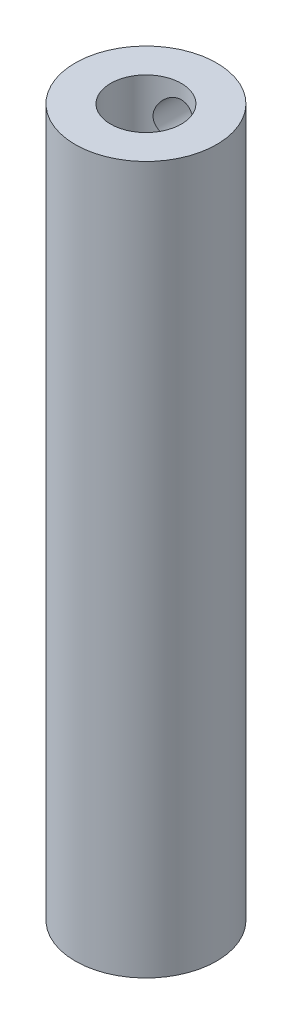
ISO-10303-21;
HEADER;
FILE_DESCRIPTION(('STEP AP214'),'2;1');
FILE_NAME('part.step','',(''),(''),'','','');
FILE_SCHEMA(('AUTOMOTIVE_DESIGN { 1 0 10303 214 1 1 1 1 }'));
ENDSEC;
DATA;
#1=APPLICATION_CONTEXT('core data for automotive mechanical design processes');
#2=APPLICATION_PROTOCOL_DEFINITION('international standard','automotive_design',2000,#1);
#3=PRODUCT_CONTEXT('',#1,'mechanical');
#4=PRODUCT('Part','Part','',(#3));
#5=PRODUCT_RELATED_PRODUCT_CATEGORY('part','',(#4));
#6=PRODUCT_DEFINITION_FORMATION('','',#4);
#7=PRODUCT_DEFINITION_CONTEXT('part definition',#1,'design');
#8=PRODUCT_DEFINITION('design','',#6,#7);
#9=PRODUCT_DEFINITION_SHAPE('','',#8);
#10=(LENGTH_UNIT() NAMED_UNIT(*) SI_UNIT(.MILLI.,.METRE.));
#11=(NAMED_UNIT(*) PLANE_ANGLE_UNIT() SI_UNIT($,.RADIAN.));
#12=(NAMED_UNIT(*) SI_UNIT($,.STERADIAN.) SOLID_ANGLE_UNIT());
#13=UNCERTAINTY_MEASURE_WITH_UNIT(LENGTH_MEASURE(1.E-05),#10,'distance_accuracy_value','');
#14=(GEOMETRIC_REPRESENTATION_CONTEXT(3) GLOBAL_UNCERTAINTY_ASSIGNED_CONTEXT((#13)) GLOBAL_UNIT_ASSIGNED_CONTEXT((#10,
#11,#12)) REPRESENTATION_CONTEXT('',''));
#15=CARTESIAN_POINT('',(0.,0.,0.));
#16=DIRECTION('',(0.,0.,1.));
#17=DIRECTION('',(1.,0.,0.));
#18=AXIS2_PLACEMENT_3D('',#15,#16,#17);
#19=CARTESIAN_POINT('',(0.,100.,0.));
#20=DIRECTION('',(0.,-1.,0.));
#21=DIRECTION('',(0.,0.,-1.));
#22=AXIS2_PLACEMENT_3D('',#19,#20,#21);
#23=CYLINDRICAL_SURFACE('',#22,10.);
#24=CARTESIAN_POINT('',(0.,98.,-10.));
#25=CARTESIAN_POINT('',(-0.1645772255066,97.9999980050302,-9.99999858501101));
#26=CARTESIAN_POINT('',(-0.32917463670306,97.9864122727521,-9.99589831387907));
#27=CARTESIAN_POINT('',(-0.653576250609763,97.9325572915558,-9.97994211187382));
#28=CARTESIAN_POINT('',(-0.81337900882284,97.8922800839533,-9.96808386779384));
#29=CARTESIAN_POINT('',(-1.12346541550906,97.7865079661795,-9.93791105003673));
#30=CARTESIAN_POINT('',(-1.27376272879075,97.7210502607621,-9.91960600500851));
#31=CARTESIAN_POINT('',(-1.56124836210627,97.5669278138883,-9.8784421847529));
#32=CARTESIAN_POINT('',(-1.69843493493934,97.4782599852092,-9.85558280384133));
#33=CARTESIAN_POINT('',(-1.95974359436749,97.2775519850547,-9.80701474385548));
#34=CARTESIAN_POINT('',(-2.08343614248869,97.1649667482282,-9.78124767314072));
#35=CARTESIAN_POINT('',(-2.31049841846648,96.9207815401796,-9.73011668420884));
#36=CARTESIAN_POINT('',(-2.41386472654882,96.7891783757501,-9.70475283449003));
#37=CARTESIAN_POINT('',(-2.59960075447416,96.5070584939248,-9.65668227987544));
#38=CARTESIAN_POINT('',(-2.68144618044427,96.3561830780185,-9.63404813327749));
#39=CARTESIAN_POINT('',(-2.81842789549521,96.0420214915394,-9.59487240788062));
#40=CARTESIAN_POINT('',(-2.87357059839947,95.8787383121441,-9.57832936626621));
#41=CARTESIAN_POINT('',(-2.95403267365304,95.5492194677391,-9.55381741676868));
#42=CARTESIAN_POINT('',(-2.98014392469355,95.3831945122721,-9.54562138649067));
#43=CARTESIAN_POINT('',(-3.00427461229344,95.0489336875665,-9.53805579499534));
#44=CARTESIAN_POINT('',(-3.00230085522157,94.8806983638818,-9.53868409521142));
#45=CARTESIAN_POINT('',(-2.97093954399624,94.553232182783,-9.54849488135555));
#46=CARTESIAN_POINT('',(-2.9425441052537,94.3938954992755,-9.55736777198281));
#47=CARTESIAN_POINT('',(-2.86074840854112,94.0823604274531,-9.58216712457249));
#48=CARTESIAN_POINT('',(-2.80734568283282,93.9301627452513,-9.59809428264701));
#49=CARTESIAN_POINT('',(-2.67632053307363,93.6347993006785,-9.63545466149946));
#50=CARTESIAN_POINT('',(-2.59837633869285,93.4917858320895,-9.65696032231904));
#51=CARTESIAN_POINT('',(-2.42070445177366,93.2205359559796,-9.70301974000129));
#52=CARTESIAN_POINT('',(-2.32097148005177,93.0923031411724,-9.72757423493982));
#53=CARTESIAN_POINT('',(-2.09762581531093,92.848627618476,-9.77822022595874));
#54=CARTESIAN_POINT('',(-1.97318981493395,92.7339426719407,-9.80433308620996));
#55=CARTESIAN_POINT('',(-1.70652651862793,92.5268920318715,-9.85424488126517));
#56=CARTESIAN_POINT('',(-1.56429810372178,92.4345277431711,-9.8780436703682));
#57=CARTESIAN_POINT('',(-1.2647100766856,92.2742801550705,-9.92086320138941));
#58=CARTESIAN_POINT('',(-1.1072554994959,92.2065649675003,-9.93985087336628));
#59=CARTESIAN_POINT('',(-0.782490831207035,92.0988008198007,-9.97067043664444));
#60=CARTESIAN_POINT('',(-0.615183503179159,92.058744142935,-9.98250432373999));
#61=CARTESIAN_POINT('',(-0.28190448533666,92.0086956442012,-9.99736729287077));
#62=CARTESIAN_POINT('',(-0.11610019520237,91.9976768283968,-10.0006970083558));
#63=CARTESIAN_POINT('',(0.21499921164677,92.0031383114242,-9.99905846483519));
#64=CARTESIAN_POINT('',(0.380294393381566,92.0196149393029,-9.99409131355514));
#65=CARTESIAN_POINT('',(0.701807210619397,92.078769222223,-9.97661393974325));
#66=CARTESIAN_POINT('',(0.85814554522834,92.1208467751618,-9.96427659598829));
#67=CARTESIAN_POINT('',(1.16150927790904,92.2292864655564,-9.9334869568307));
#68=CARTESIAN_POINT('',(1.30853355405117,92.2956515220757,-9.91503392642188));
#69=CARTESIAN_POINT('',(1.59287437892211,92.4525063309623,-9.87339308702631));
#70=CARTESIAN_POINT('',(1.72988765239934,92.543518681896,-9.8501056165928));
#71=CARTESIAN_POINT('',(1.9870466159603,92.7464495081056,-9.80146937528704));
#72=CARTESIAN_POINT('',(2.10718806471189,92.8583732237753,-9.77612008862419));
#73=CARTESIAN_POINT('',(2.33171489102053,93.1047746167387,-9.72506343738006));
#74=CARTESIAN_POINT('',(2.43536962463001,93.2399237515436,-9.69937650065513));
#75=CARTESIAN_POINT('',(2.61857990144313,93.5262558780269,-9.65153030477949));
#76=CARTESIAN_POINT('',(2.69813607658965,93.6774384491158,-9.62937095313121));
#77=CARTESIAN_POINT('',(2.83034694254316,93.99106498251,-9.5913437922631));
#78=CARTESIAN_POINT('',(2.88312693874022,94.1534523730757,-9.57544675673501));
#79=CARTESIAN_POINT('',(2.96043461630306,94.4853759378605,-9.55183188739737));
#80=CARTESIAN_POINT('',(2.98497197957849,94.6549096415661,-9.54411125069387));
#81=CARTESIAN_POINT('',(3.0044396896993,94.9887230367768,-9.53799944941558));
#82=CARTESIAN_POINT('',(3.00056110615887,95.1529273020988,-9.53923294700394));
#83=CARTESIAN_POINT('',(2.96615010888611,95.4782282068012,-9.54998802392188));
#84=CARTESIAN_POINT('',(2.93561876249408,95.639324970361,-9.55950927135902));
#85=CARTESIAN_POINT('',(2.84953777608686,95.9518907982633,-9.58551527389243));
#86=CARTESIAN_POINT('',(2.79430351014248,96.1034545747174,-9.60191209104934));
#87=CARTESIAN_POINT('',(2.66063014242148,96.3952848776414,-9.63980557805265));
#88=CARTESIAN_POINT('',(2.58218659925723,96.5355492352832,-9.6613032238508));
#89=CARTESIAN_POINT('',(2.40097527610176,96.8063262330525,-9.70795352855338));
#90=CARTESIAN_POINT('',(2.29742552185996,96.9362975225204,-9.7332108032858));
#91=CARTESIAN_POINT('',(2.07034869259555,97.1774049966162,-9.78402640899066));
#92=CARTESIAN_POINT('',(1.94681643426897,97.2885362789357,-9.80958481647543));
#93=CARTESIAN_POINT('',(1.67893152436651,97.4920468245899,-9.85901873141573));
#94=CARTESIAN_POINT('',(1.53407577158121,97.583782893711,-9.88282319531422));
#95=CARTESIAN_POINT('',(1.23028274796705,97.7414703398081,-9.92521360911553));
#96=CARTESIAN_POINT('',(1.07135210599791,97.807433776549,-9.94380199862114));
#97=CARTESIAN_POINT('',(0.761515425310564,97.9057905513055,-9.97204349938619));
#98=CARTESIAN_POINT('',(0.611573923908469,97.9410233457665,-9.9824405476214));
#99=CARTESIAN_POINT('',(0.307760390461559,97.9881270504832,-9.9964188898898));
#100=CARTESIAN_POINT('',(0.153889019716279,98.0000018654096,-10.0000013230948));
#101=CARTESIAN_POINT('',(0.,98.,-10.));
#102=B_SPLINE_CURVE_WITH_KNOTS('',3,(#24,#25,#26,#27,#28,#29,#30,#31,#32,#33,#34,#35,#36,#37,
#38,#39,#40,#41,#42,#43,#44,#45,#46,#47,#48,#49,#50,#51,#52,#53,#54,#55,#56,#57,#58,#59,#60,#61,
#62,#63,#64,#65,#66,#67,#68,#69,#70,#71,#72,#73,#74,#75,#76,#77,#78,#79,#80,#81,#82,#83,#84,#85,
#86,#87,#88,#89,#90,#91,#92,#93,#94,#95,#96,#97,#98,#99,#100,#101),.UNSPECIFIED.,.T.,.F.,(4,2,2,
2,2,2,2,2,2,2,2,2,2,2,2,2,2,2,2,2,2,2,2,2,2,2,2,2,2,2,2,2,2,2,2,2,2,2,4),(0.,0.493166407225222,
0.986479929692002,1.47906735260176,1.97172032882541,2.47711205896383,2.98258874577267,
3.4994296200822,4.01614629086448,4.51839378713199,5.02051956638179,5.50452033395355,
5.98856887316005,6.47924852894241,6.97004720317112,7.48134208096335,7.99266913062144,
8.50742093763379,9.02202907057617,9.51817618877092,10.0142570710066,10.4991349336466,
10.9840710918746,11.4802261140582,11.9765056400038,12.4908080064564,13.0050968850536,
13.516956299025,14.0286401892057,14.5190031093854,15.0093463933232,15.4936008081456,
15.9779479511534,16.4799385136898,16.9820594980413,17.4988599232247,18.0154182319959,
18.4766338387004,18.9377723390687),.UNSPECIFIED.);
#103=CARTESIAN_POINT('',(0.,98.,-10.));
#104=VERTEX_POINT('',#103);
#105=EDGE_CURVE('E66',#104,#104,#102,.T.);
#106=ORIENTED_EDGE('',*,*,#105,.T.);
#107=EDGE_LOOP('',(#106));
#108=FACE_BOUND('',#107,.T.);
#109=CARTESIAN_POINT('',(0.,100.,0.));
#110=DIRECTION('',(0.,1.,0.));
#111=DIRECTION('',(0.,0.,1.));
#112=AXIS2_PLACEMENT_3D('',#109,#110,#111);
#113=CIRCLE('',#112,10.);
#114=CARTESIAN_POINT('',(0.,100.,10.));
#115=VERTEX_POINT('',#114);
#116=EDGE_CURVE('E10',#115,#115,#113,.T.);
#117=ORIENTED_EDGE('',*,*,#116,.F.);
#118=EDGE_LOOP('',(#117));
#119=FACE_BOUND('',#118,.T.);
#120=CARTESIAN_POINT('',(0.,0.,0.));
#121=DIRECTION('',(0.,1.,0.));
#122=DIRECTION('',(0.,0.,1.));
#123=AXIS2_PLACEMENT_3D('',#120,#121,#122);
#124=CIRCLE('',#123,10.);
#125=CARTESIAN_POINT('',(0.,0.,10.));
#126=VERTEX_POINT('',#125);
#127=EDGE_CURVE('E54',#126,#126,#124,.T.);
#128=ORIENTED_EDGE('',*,*,#127,.T.);
#129=EDGE_LOOP('',(#128));
#130=FACE_BOUND('',#129,.T.);
#131=ADVANCED_FACE('F40',(#108,#119,#130),#23,.T.);
#132=CARTESIAN_POINT('',(0.,100.,0.));
#133=DIRECTION('',(0.,1.,0.));
#134=DIRECTION('',(0.,0.,1.));
#135=AXIS2_PLACEMENT_3D('',#132,#133,#134);
#136=PLANE('',#135);
#137=CARTESIAN_POINT('',(0.,100.,0.));
#138=DIRECTION('',(0.,1.,0.));
#139=DIRECTION('',(0.,0.,1.));
#140=AXIS2_PLACEMENT_3D('',#137,#138,#139);
#141=CIRCLE('',#140,5.);
#142=CARTESIAN_POINT('',(0.,100.,5.));
#143=VERTEX_POINT('',#142);
#144=EDGE_CURVE('E62',#143,#143,#141,.T.);
#145=ORIENTED_EDGE('',*,*,#144,.F.);
#146=EDGE_LOOP('',(#145));
#147=FACE_BOUND('',#146,.T.);
#148=ORIENTED_EDGE('',*,*,#116,.T.);
#149=EDGE_LOOP('',(#148));
#150=FACE_BOUND('',#149,.T.);
#151=ADVANCED_FACE('F90',(#147,#150),#136,.T.);
#152=CARTESIAN_POINT('',(0.,0.,0.));
#153=DIRECTION('',(0.,1.,0.));
#154=DIRECTION('',(0.,0.,1.));
#155=AXIS2_PLACEMENT_3D('',#152,#153,#154);
#156=PLANE('',#155);
#157=ORIENTED_EDGE('',*,*,#127,.F.);
#158=EDGE_LOOP('',(#157));
#159=FACE_BOUND('',#158,.T.);
#160=ADVANCED_FACE('F88',(#159),#156,.F.);
#161=CARTESIAN_POINT('',(0.,80.,0.));
#162=DIRECTION('',(0.,1.,0.));
#163=DIRECTION('',(0.,0.,1.));
#164=AXIS2_PLACEMENT_3D('',#161,#162,#163);
#165=CYLINDRICAL_SURFACE('',#164,5.);
#166=CARTESIAN_POINT('',(3.,95.,-4.));
#167=CARTESIAN_POINT('',(2.9999999059924,94.9245383896343,-3.99999997094658));
#168=CARTESIAN_POINT('',(2.99714660074499,94.8490800481743,-4.00214560778386));
#169=CARTESIAN_POINT('',(2.98579602023829,94.6988164208441,-4.01061905841259));
#170=CARTESIAN_POINT('',(2.97729658251829,94.6240113963193,-4.01694847458097));
#171=CARTESIAN_POINT('',(2.94350195877001,94.4014575991999,-4.04185988554313));
#172=CARTESIAN_POINT('',(2.90991036792577,94.2555338369613,-4.06636523363867));
#173=CARTESIAN_POINT('',(2.82286888064332,93.973804706127,-4.12724466313279));
#174=CARTESIAN_POINT('',(2.76956233581239,93.8379345902785,-4.16353284212727));
#175=CARTESIAN_POINT('',(2.64505893939301,93.577132828574,-4.24371857831163));
#176=CARTESIAN_POINT('',(2.57385675138361,93.4522044605218,-4.28761840405594));
#177=CARTESIAN_POINT('',(2.40542341931063,93.2000986897546,-4.3845721143975));
#178=CARTESIAN_POINT('',(2.30607419983946,93.0745139192543,-4.43808896832273));
#179=CARTESIAN_POINT('',(2.08854542159204,92.8404746436311,-4.54452303763807));
#180=CARTESIAN_POINT('',(1.97035175093535,92.7320330985768,-4.59743977155758));
#181=CARTESIAN_POINT('',(1.70284578042267,92.5237175312858,-4.70351798165428));
#182=CARTESIAN_POINT('',(1.55155129309906,92.4260335863589,-4.75608869625048));
#183=CARTESIAN_POINT('',(1.31132430439157,92.300253491412,-4.82570563669468));
#184=CARTESIAN_POINT('',(1.22900736782604,92.2617758845419,-4.84737661360987));
#185=CARTESIAN_POINT('',(1.06047221299631,92.1922090351209,-4.88701002756049));
#186=CARTESIAN_POINT('',(0.974256618946842,92.1611149082884,-4.90497491519086));
#187=CARTESIAN_POINT('',(0.806968026671435,92.1093725375467,-4.9351119388654));
#188=CARTESIAN_POINT('',(0.726184158740188,92.0880127284709,-4.94767216447126));
#189=CARTESIAN_POINT('',(0.562666348744431,92.052050038649,-4.96892323787741));
#190=CARTESIAN_POINT('',(0.479933520527563,92.0374433923624,-4.97761624192487));
#191=CARTESIAN_POINT('',(0.313244621267393,92.0152153154839,-4.99087754875312));
#192=CARTESIAN_POINT('',(0.229289227265366,92.0075901576882,-4.99544805239181));
#193=CARTESIAN_POINT('',(0.0609397888852076,91.9994333601528,-5.00033941607428));
#194=CARTESIAN_POINT('',(-0.0234542099897559,91.9989009987064,-5.00066070848407));
#195=CARTESIAN_POINT('',(-0.255171183646353,92.0072427822797,-4.99565270087357));
#196=CARTESIAN_POINT('',(-0.402219957267165,92.0234711496492,-4.98590479614142));
#197=CARTESIAN_POINT('',(-0.690956248818423,92.0769554936824,-4.95416390550291));
#198=CARTESIAN_POINT('',(-0.832643369131341,92.1142130266105,-4.9321700133334));
#199=CARTESIAN_POINT('',(-1.10810607069191,92.208332233002,-4.87769707511975));
#200=CARTESIAN_POINT('',(-1.24183096722661,92.2653064201999,-4.84515792140775));
#201=CARTESIAN_POINT('',(-1.49797933560354,92.3967689344517,-4.77219304045846));
#202=CARTESIAN_POINT('',(-1.62039986081242,92.4712618101359,-4.73176526544935));
#203=CARTESIAN_POINT('',(-1.86614789799246,92.6456782796185,-4.64075842839173));
#204=CARTESIAN_POINT('',(-1.98783715480756,92.7475766485355,-4.58954363323803));
#205=CARTESIAN_POINT('',(-2.2134294892317,92.9688082101049,-4.48511110796774));
#206=CARTESIAN_POINT('',(-2.31730807434112,93.0881649997191,-4.4318907405416));
#207=CARTESIAN_POINT('',(-2.51649670159326,93.3573068203978,-4.32222149525339));
#208=CARTESIAN_POINT('',(-2.60941864927586,93.5090151553296,-4.26611322583746));
#209=CARTESIAN_POINT('',(-2.76794435835452,93.8294124610267,-4.16501759300692));
#210=CARTESIAN_POINT('',(-2.83359844351373,93.9980694313142,-4.12000980621702));
#211=CARTESIAN_POINT('',(-2.92154993808436,94.3047872644956,-4.05791730375361));
#212=CARTESIAN_POINT('',(-2.95055806318485,94.4400812657923,-4.03667777278558));
#213=CARTESIAN_POINT('',(-2.98961745817056,94.7147472194013,-4.00784301513237));
#214=CARTESIAN_POINT('',(-2.9996907751055,94.8541142368845,-4.00023192044755));
#215=CARTESIAN_POINT('',(-3.00029561322377,95.1331033689617,-3.9997782882838));
#216=CARTESIAN_POINT('',(-2.99080006076193,95.2727255696018,-4.00695621149423));
#217=CARTESIAN_POINT('',(-2.95280584471632,95.5479746723138,-4.03503040875294));
#218=CARTESIAN_POINT('',(-2.92429216045109,95.6835983278199,-4.05593752603304));
#219=CARTESIAN_POINT('',(-2.84976612867926,95.9474292155495,-4.10863539286051));
#220=CARTESIAN_POINT('',(-2.8037756438149,96.0756454841376,-4.14041253958233));
#221=CARTESIAN_POINT('',(-2.69592568264799,96.3229552203076,-4.21143069058875));
#222=CARTESIAN_POINT('',(-2.63406022035169,96.4420452245939,-4.25067450889247));
#223=CARTESIAN_POINT('',(-2.48334675803859,96.6904810952464,-4.34073681424695));
#224=CARTESIAN_POINT('',(-2.39164503852697,96.8178054323295,-4.39236652981541));
#225=CARTESIAN_POINT('',(-2.18975614095888,97.0565672039455,-4.49643335252965));
#226=CARTESIAN_POINT('',(-2.07955127457128,97.1679892460945,-4.54887118822614));
#227=CARTESIAN_POINT('',(-1.82651475528319,97.3864639913158,-4.65671991538656));
#228=CARTESIAN_POINT('',(-1.68130397020024,97.4910647057629,-4.71163080343123));
#229=CARTESIAN_POINT('',(-1.44944631278507,97.6281544977234,-4.78599458202113));
#230=CARTESIAN_POINT('',(-1.36978605711648,97.6705620021369,-4.80945640676868));
#231=CARTESIAN_POINT('',(-1.20623656162319,97.7483038834785,-4.85305400686528));
#232=CARTESIAN_POINT('',(-1.12235002598568,97.7836427131187,-4.8731918746406));
#233=CARTESIAN_POINT('',(-0.95714069877488,97.8444796432345,-4.90820667253682));
#234=CARTESIAN_POINT('',(-0.876069467337932,97.8705037184618,-4.92335831278731));
#235=CARTESIAN_POINT('',(-0.711460619981253,97.9156649816091,-4.94982497459132));
#236=CARTESIAN_POINT('',(-0.62792441470878,97.9348060288799,-4.9611421459459));
#237=CARTESIAN_POINT('',(-0.459119615082229,97.9659003097131,-4.97959903931251));
#238=CARTESIAN_POINT('',(-0.373852241303997,97.9778584373606,-4.98674160560363));
#239=CARTESIAN_POINT('',(-0.202384159163426,97.994406761659,-4.99664216975595));
#240=CARTESIAN_POINT('',(-0.116183573945371,97.998997918789,-4.99940073918633));
#241=CARTESIAN_POINT('',(0.119519384080627,98.0013282897594,-5.00079353601933));
#242=CARTESIAN_POINT('',(0.269213134971632,97.9916010745741,-4.9949361975757));
#243=CARTESIAN_POINT('',(0.5643255444776,97.9502179458511,-4.97026391444783));
#244=CARTESIAN_POINT('',(0.709744155455524,97.9185617880599,-4.95144882543496));
#245=CARTESIAN_POINT('',(0.990283617430318,97.8355594293537,-4.90298726022976));
#246=CARTESIAN_POINT('',(1.12553205648684,97.784536560451,-4.87351900635896));
#247=CARTESIAN_POINT('',(1.38556595318156,97.6647190582365,-4.80606707983649));
#248=CARTESIAN_POINT('',(1.510349056203,97.5959204396564,-4.76808149787883));
#249=CARTESIAN_POINT('',(1.76052652812019,97.4341500931042,-4.6818686167897));
#250=CARTESIAN_POINT('',(1.884516634541,97.3393649364719,-4.63297714592575));
#251=CARTESIAN_POINT('',(2.11579577789692,97.1324915754345,-4.53203789358828));
#252=CARTESIAN_POINT('',(2.22306604531467,97.0203842023356,-4.47998665474641));
#253=CARTESIAN_POINT('',(2.43181699852646,96.7654389566212,-4.37056449731606));
#254=CARTESIAN_POINT('',(2.53083841179817,96.6205069155109,-4.31335603990192));
#255=CARTESIAN_POINT('',(2.70314606061128,96.3129904274047,-4.20752457767501));
#256=CARTESIAN_POINT('',(2.77644567607671,96.1504152158019,-4.15889711577765));
#257=CARTESIAN_POINT('',(2.86193484914581,95.9033774473123,-4.10004730463764));
#258=CARTESIAN_POINT('',(2.88571236613334,95.8243414087028,-4.08329508678219));
#259=CARTESIAN_POINT('',(2.92679381745553,95.6638695581998,-4.05395087655968));
#260=CARTESIAN_POINT('',(2.94410184772357,95.5824353000126,-4.04135625254711));
#261=CARTESIAN_POINT('',(2.97191221271434,95.4179534493059,-4.0209497222627));
#262=CARTESIAN_POINT('',(2.98242533831514,95.3349086316283,-4.01313023377048));
#263=CARTESIAN_POINT('',(2.99646884485439,95.1679077833364,-4.00265571377826));
#264=CARTESIAN_POINT('',(3.00000010458449,95.0839518687376,-4.00000003232224));
#265=CARTESIAN_POINT('',(3.,95.,-4.));
#266=B_SPLINE_CURVE_WITH_KNOTS('',3,(#166,#167,#168,#169,#170,#171,#172,#173,#174,#175,#176,
#177,#178,#179,#180,#181,#182,#183,#184,#185,#186,#187,#188,#189,#190,#191,#192,#193,#194,#195,
#196,#197,#198,#199,#200,#201,#202,#203,#204,#205,#206,#207,#208,#209,#210,#211,#212,#213,#214,
#215,#216,#217,#218,#219,#220,#221,#222,#223,#224,#225,#226,#227,#228,#229,#230,#231,#232,#233,
#234,#235,#236,#237,#238,#239,#240,#241,#242,#243,#244,#245,#246,#247,#248,#249,#250,#251,#252,
#253,#254,#255,#256,#257,#258,#259,#260,#261,#262,#263,#264,#265),.UNSPECIFIED.,.T.,.F.,(4,2,2,
2,2,2,2,2,2,2,2,2,2,2,2,2,2,2,2,2,2,2,2,2,2,2,2,2,2,2,2,2,2,2,2,2,2,2,2,2,2,2,2,2,2,2,2,2,2,4),
(0.,0.226288173517875,0.452663065091109,0.905305714765855,1.35471981612576,1.80426809059901,
2.30878181396803,2.81367513819685,3.37309572088444,3.65297634398312,3.9326713028733,
4.18580566749444,4.43879871451847,4.69165661737851,4.94448879122709,5.38694235003539,
5.82942865693065,6.2744828398993,6.71965270654933,7.2179959402683,7.71701907227944,
8.2738731619468,8.82969494223663,9.24786570023497,9.66554925202083,10.0838110593649,
10.5024036052239,10.9204742264512,11.3387027222345,11.8323285087814,12.3264288987104,
12.8847762993731,13.1641700331409,13.4433872125908,13.7024631857777,13.9613936663243,
14.2201475237759,14.4788676430947,14.9267946196282,15.3747265854332,15.8154875864153,
16.2563474905319,16.74506745363,17.2343321574793,17.7856420979723,18.3366648323363,
18.5890061072372,18.8411873492279,19.0929671157917,19.3447151893882),.UNSPECIFIED.);
#267=CARTESIAN_POINT('',(3.,95.,-4.));
#268=VERTEX_POINT('',#267);
#269=EDGE_CURVE('E44',#268,#268,#266,.T.);
#270=ORIENTED_EDGE('',*,*,#269,.T.);
#271=EDGE_LOOP('',(#270));
#272=FACE_BOUND('',#271,.T.);
#273=CARTESIAN_POINT('',(0.,80.,0.));
#274=DIRECTION('',(0.,1.,0.));
#275=DIRECTION('',(0.,0.,1.));
#276=AXIS2_PLACEMENT_3D('',#273,#274,#275);
#277=CIRCLE('',#276,5.);
#278=CARTESIAN_POINT('',(0.,80.,5.));
#279=VERTEX_POINT('',#278);
#280=EDGE_CURVE('E60',#279,#279,#277,.T.);
#281=ORIENTED_EDGE('',*,*,#280,.F.);
#282=EDGE_LOOP('',(#281));
#283=FACE_BOUND('',#282,.T.);
#284=ORIENTED_EDGE('',*,*,#144,.T.);
#285=EDGE_LOOP('',(#284));
#286=FACE_BOUND('',#285,.T.);
#287=ADVANCED_FACE('F83',(#272,#283,#286),#165,.F.);
#288=CARTESIAN_POINT('',(0.,80.,0.));
#289=DIRECTION('',(0.,1.,0.));
#290=DIRECTION('',(0.,0.,1.));
#291=AXIS2_PLACEMENT_3D('',#288,#289,#290);
#292=PLANE('',#291);
#293=ORIENTED_EDGE('',*,*,#280,.T.);
#294=EDGE_LOOP('',(#293));
#295=FACE_BOUND('',#294,.T.);
#296=ADVANCED_FACE('F79',(#295),#292,.T.);
#297=CARTESIAN_POINT('',(0.,95.,-18.));
#298=DIRECTION('',(0.,0.,1.));
#299=DIRECTION('',(1.,0.,0.));
#300=AXIS2_PLACEMENT_3D('',#297,#298,#299);
#301=CYLINDRICAL_SURFACE('',#300,3.);
#302=ORIENTED_EDGE('',*,*,#269,.F.);
#303=EDGE_LOOP('',(#302));
#304=FACE_BOUND('',#303,.T.);
#305=ORIENTED_EDGE('',*,*,#105,.F.);
#306=EDGE_LOOP('',(#305));
#307=FACE_BOUND('',#306,.T.);
#308=ADVANCED_FACE('F75',(#304,#307),#301,.F.);
#309=CLOSED_SHELL('',(#131,#151,#160,#287,#296,#308));
#310=MANIFOLD_SOLID_BREP('B2',#309);
#311=ADVANCED_BREP_SHAPE_REPRESENTATION('',(#18,#310),#14);
#312=SHAPE_DEFINITION_REPRESENTATION(#9,#311);
ENDSEC;
END-ISO-10303-21;
